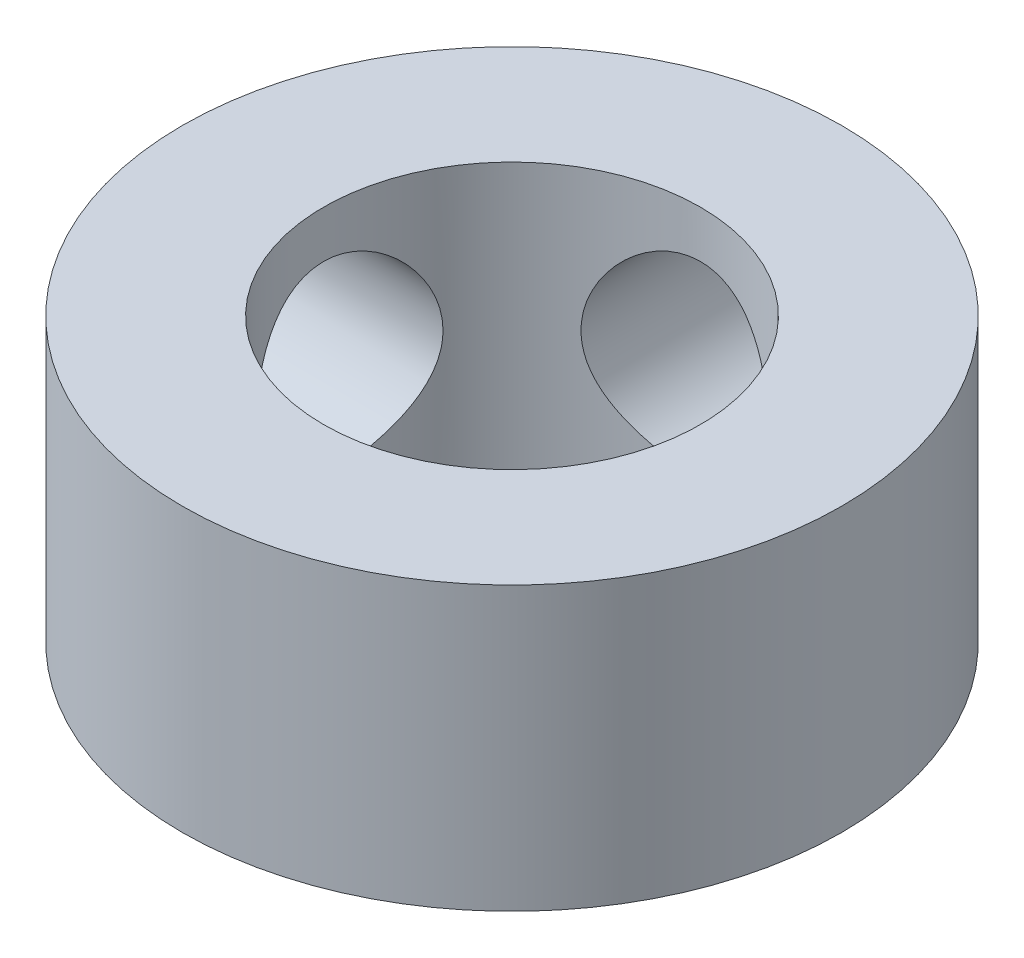
ISO-10303-21;
HEADER;
FILE_DESCRIPTION(('STEP AP214'),'2;1');
FILE_NAME('part.step','',(''),(''),'','','');
FILE_SCHEMA(('AUTOMOTIVE_DESIGN { 1 0 10303 214 1 1 1 1 }'));
ENDSEC;
DATA;
#1=APPLICATION_CONTEXT('core data for automotive mechanical design processes');
#2=APPLICATION_PROTOCOL_DEFINITION('international standard','automotive_design',2000,#1);
#3=PRODUCT_CONTEXT('',#1,'mechanical');
#4=PRODUCT('Part','Part','',(#3));
#5=PRODUCT_RELATED_PRODUCT_CATEGORY('part','',(#4));
#6=PRODUCT_DEFINITION_FORMATION('','',#4);
#7=PRODUCT_DEFINITION_CONTEXT('part definition',#1,'design');
#8=PRODUCT_DEFINITION('design','',#6,#7);
#9=PRODUCT_DEFINITION_SHAPE('','',#8);
#10=(LENGTH_UNIT() NAMED_UNIT(*) SI_UNIT(.MILLI.,.METRE.));
#11=(NAMED_UNIT(*) PLANE_ANGLE_UNIT() SI_UNIT($,.RADIAN.));
#12=(NAMED_UNIT(*) SI_UNIT($,.STERADIAN.) SOLID_ANGLE_UNIT());
#13=UNCERTAINTY_MEASURE_WITH_UNIT(LENGTH_MEASURE(1.E-05),#10,'distance_accuracy_value','');
#14=(GEOMETRIC_REPRESENTATION_CONTEXT(3) GLOBAL_UNCERTAINTY_ASSIGNED_CONTEXT((#13)) GLOBAL_UNIT_ASSIGNED_CONTEXT((#10,
#11,#12)) REPRESENTATION_CONTEXT('',''));
#15=CARTESIAN_POINT('',(0.,0.,0.));
#16=DIRECTION('',(0.,0.,1.));
#17=DIRECTION('',(1.,0.,0.));
#18=AXIS2_PLACEMENT_3D('',#15,#16,#17);
#19=CARTESIAN_POINT('',(0.,6.,0.));
#20=DIRECTION('',(0.,1.,0.));
#21=DIRECTION('',(0.,0.,1.));
#22=AXIS2_PLACEMENT_3D('',#19,#20,#21);
#23=PLANE('',#22);
#24=CARTESIAN_POINT('',(0.,6.,0.));
#25=DIRECTION('',(0.,1.,0.));
#26=DIRECTION('',(0.,0.,1.));
#27=AXIS2_PLACEMENT_3D('',#24,#25,#26);
#28=CIRCLE('',#27,7.);
#29=CARTESIAN_POINT('',(0.,6.,7.));
#30=VERTEX_POINT('',#29);
#31=EDGE_CURVE('E10',#30,#30,#28,.T.);
#32=ORIENTED_EDGE('',*,*,#31,.T.);
#33=EDGE_LOOP('',(#32));
#34=FACE_BOUND('',#33,.T.);
#35=CARTESIAN_POINT('',(0.,6.,0.));
#36=DIRECTION('',(0.,1.,0.));
#37=DIRECTION('',(0.,0.,1.));
#38=AXIS2_PLACEMENT_3D('',#35,#36,#37);
#39=CIRCLE('',#38,4.);
#40=CARTESIAN_POINT('',(0.,6.,4.));
#41=VERTEX_POINT('',#40);
#42=EDGE_CURVE('E58',#41,#41,#39,.T.);
#43=ORIENTED_EDGE('',*,*,#42,.F.);
#44=EDGE_LOOP('',(#43));
#45=FACE_BOUND('',#44,.T.);
#46=ADVANCED_FACE('F37',(#34,#45),#23,.T.);
#47=CARTESIAN_POINT('',(0.,0.,0.));
#48=DIRECTION('',(0.,1.,0.));
#49=DIRECTION('',(0.,0.,1.));
#50=AXIS2_PLACEMENT_3D('',#47,#48,#49);
#51=PLANE('',#50);
#52=CARTESIAN_POINT('',(0.,0.,0.));
#53=DIRECTION('',(0.,1.,0.));
#54=DIRECTION('',(0.,0.,1.));
#55=AXIS2_PLACEMENT_3D('',#52,#53,#54);
#56=CIRCLE('',#55,7.);
#57=CARTESIAN_POINT('',(0.,0.,7.));
#58=VERTEX_POINT('',#57);
#59=EDGE_CURVE('E52',#58,#58,#56,.T.);
#60=ORIENTED_EDGE('',*,*,#59,.F.);
#61=EDGE_LOOP('',(#60));
#62=FACE_BOUND('',#61,.T.);
#63=CARTESIAN_POINT('',(0.,0.,0.));
#64=DIRECTION('',(0.,1.,0.));
#65=DIRECTION('',(0.,0.,1.));
#66=AXIS2_PLACEMENT_3D('',#63,#64,#65);
#67=CIRCLE('',#66,4.);
#68=CARTESIAN_POINT('',(0.,0.,4.));
#69=VERTEX_POINT('',#68);
#70=EDGE_CURVE('E61',#69,#69,#67,.T.);
#71=ORIENTED_EDGE('',*,*,#70,.T.);
#72=EDGE_LOOP('',(#71));
#73=FACE_BOUND('',#72,.T.);
#74=ADVANCED_FACE('F100',(#62,#73),#51,.F.);
#75=CARTESIAN_POINT('',(0.,6.,0.));
#76=DIRECTION('',(0.,-1.,0.));
#77=DIRECTION('',(0.,0.,-1.));
#78=AXIS2_PLACEMENT_3D('',#75,#76,#77);
#79=CYLINDRICAL_SURFACE('',#78,7.);
#80=CARTESIAN_POINT('',(0.,5.,-7.));
#81=CARTESIAN_POINT('',(-0.109954902377251,4.99999806043805,-6.99999869294341));
#82=CARTESIAN_POINT('',(-0.219929747872582,4.99090221102389,-6.99738417402043));
#83=CARTESIAN_POINT('',(-0.436691991196989,4.95483572989769,-6.98720905945103));
#84=CARTESIAN_POINT('',(-0.543478166829615,4.92785833392591,-6.97964659210084));
#85=CARTESIAN_POINT('',(-0.75070430073787,4.85699196158349,-6.96040691349073));
#86=CARTESIAN_POINT('',(-0.851152880848224,4.81312656384805,-6.94873544106341));
#87=CARTESIAN_POINT('',(-1.04326876112927,4.70982200852165,-6.92249978316544));
#88=CARTESIAN_POINT('',(-1.13493514117816,4.65038122150964,-6.90793529508022));
#89=CARTESIAN_POINT('',(-1.30929444685894,4.51596498932709,-6.8770473462558));
#90=CARTESIAN_POINT('',(-1.39172372238094,4.44065524614473,-6.86069041945191));
#91=CARTESIAN_POINT('',(-1.54297135792435,4.27735225686232,-6.82826734915641));
#92=CARTESIAN_POINT('',(-1.61178767707782,4.18935711236777,-6.81220124959344));
#93=CARTESIAN_POINT('',(-1.7351979000643,4.00100641720909,-6.78183014875388));
#94=CARTESIAN_POINT('',(-1.78947821103348,3.90043801493514,-6.76756702506018));
#95=CARTESIAN_POINT('',(-1.8802517055398,3.69112798824923,-6.74291343840667));
#96=CARTESIAN_POINT('',(-1.91674871555719,3.58238812792911,-6.73252214244871));
#97=CARTESIAN_POINT('',(-1.96998433013875,3.36276523683446,-6.71713608196016));
#98=CARTESIAN_POINT('',(-1.9872055320285,3.25200863723216,-6.71200978570011));
#99=CARTESIAN_POINT('',(-2.00290667789184,3.0290688515539,-6.70734208201995));
#100=CARTESIAN_POINT('',(-2.00139069409621,2.91688598074978,-6.70779946107612));
#101=CARTESIAN_POINT('',(-1.98004134762903,2.69813138854384,-6.71413034409934));
#102=CARTESIAN_POINT('',(-1.96080325728391,2.59149564881924,-6.71982782697936));
#103=CARTESIAN_POINT('',(-1.90551386085789,2.3830327803724,-6.73571348382811));
#104=CARTESIAN_POINT('',(-1.8694610348125,2.2812060872795,-6.74590206376403));
#105=CARTESIAN_POINT('',(-1.78110681137812,2.08375375556819,-6.7697686351608));
#106=CARTESIAN_POINT('',(-1.72860551172881,1.98822292759833,-6.78348916405649));
#107=CARTESIAN_POINT('',(-1.60898379167885,1.80712343878659,-6.81285216882059));
#108=CARTESIAN_POINT('',(-1.54186011673345,1.72155700226509,-6.82849507221912));
#109=CARTESIAN_POINT('',(-1.39190399673021,1.55942762439363,-6.86066250656356));
#110=CARTESIAN_POINT('',(-1.30857487484533,1.48332552403277,-6.87719804572366));
#111=CARTESIAN_POINT('',(-1.13013228238622,1.34607399635972,-6.90876247218345));
#112=CARTESIAN_POINT('',(-1.03501820148189,1.28492534395829,-6.92379128137825));
#113=CARTESIAN_POINT('',(-0.834923073091444,1.17907126522596,-6.95076528065502));
#114=CARTESIAN_POINT('',(-0.729889817810004,1.13445971319582,-6.96269275497229));
#115=CARTESIAN_POINT('',(-0.513393229967468,1.06366610858318,-6.98199251487585));
#116=CARTESIAN_POINT('',(-0.401931525810145,1.03747941075473,-6.98936594856255));
#117=CARTESIAN_POINT('',(-0.179666388644349,1.00502671429055,-6.99854874514672));
#118=CARTESIAN_POINT('',(-0.0689613468605074,0.998135304626973,-7.00053272850599));
#119=CARTESIAN_POINT('',(0.152026526805583,1.00272726630104,-6.99922084707091));
#120=CARTESIAN_POINT('',(0.262309407757108,1.01420843284592,-6.99592561580629));
#121=CARTESIAN_POINT('',(0.477018633430315,1.05471044431625,-6.98453926685206));
#122=CARTESIAN_POINT('',(0.581518211734843,1.08337318132339,-6.97654613017679));
#123=CARTESIAN_POINT('',(0.78420868620564,1.15700050198467,-6.95667998741883));
#124=CARTESIAN_POINT('',(0.882398851248717,1.20196697088933,-6.94480653265874));
#125=CARTESIAN_POINT('',(1.07204168512003,1.30802333664512,-6.91809961169145));
#126=CARTESIAN_POINT('',(1.16330248654009,1.36944119882533,-6.9032076317834));
#127=CARTESIAN_POINT('',(1.33443852805947,1.5062525059511,-6.87217947098441));
#128=CARTESIAN_POINT('',(1.41431117084304,1.58164913006457,-6.85604300755107));
#129=CARTESIAN_POINT('',(1.56310642834007,1.74720934204944,-6.82368619629443));
#130=CARTESIAN_POINT('',(1.63158542740713,1.83777527555905,-6.80748036858305));
#131=CARTESIAN_POINT('',(1.75239531606757,2.02946258862467,-6.77738894734786));
#132=CARTESIAN_POINT('',(1.8047267674867,2.13058360077126,-6.76350327310608));
#133=CARTESIAN_POINT('',(1.89137454118278,2.34009121097522,-6.73978651242836));
#134=CARTESIAN_POINT('',(1.92578633239654,2.44843576349762,-6.72993400029434));
#135=CARTESIAN_POINT('',(1.9757945006787,2.66970993557479,-6.71542456669526));
#136=CARTESIAN_POINT('',(1.99139657901587,2.78263815507641,-6.71076607094366));
#137=CARTESIAN_POINT('',(2.00298024246851,3.00529603293678,-6.70731703127619));
#138=CARTESIAN_POINT('',(1.99968027644405,3.11498550455666,-6.70831160808103));
#139=CARTESIAN_POINT('',(1.97524710957466,3.33217473066169,-6.71554597206102));
#140=CARTESIAN_POINT('',(1.95411450379873,3.43967455809192,-6.72178558421114));
#141=CARTESIAN_POINT('',(1.89505968816675,3.6483783711686,-6.73866977160527));
#142=CARTESIAN_POINT('',(1.85731091786365,3.74963538701117,-6.74926877048974));
#143=CARTESIAN_POINT('',(1.76622949301581,3.9444587344922,-6.77367302842112));
#144=CARTESIAN_POINT('',(1.71289408043152,4.03802370127323,-6.78747885482392));
#145=CARTESIAN_POINT('',(1.59006546534828,4.21818352180533,-6.81731668949935));
#146=CARTESIAN_POINT('',(1.52009227722732,4.30444139134196,-6.83340763179064));
#147=CARTESIAN_POINT('',(1.36685984037935,4.46422389580982,-6.86569845092232));
#148=CARTESIAN_POINT('',(1.28359725072856,4.5377453191108,-6.88189835417168));
#149=CARTESIAN_POINT('',(1.10357432086539,4.67183718432662,-6.91307959572365));
#150=CARTESIAN_POINT('',(1.00652250235978,4.73202698726963,-6.92801901037413));
#151=CARTESIAN_POINT('',(0.80325052964666,4.83514578502201,-6.95451395777971));
#152=CARTESIAN_POINT('',(0.697035424114739,4.87808421193306,-6.96607133870287));
#153=CARTESIAN_POINT('',(0.492916315335034,4.94084755139545,-6.98327344725308));
#154=CARTESIAN_POINT('',(0.39576300762439,4.96297353668456,-6.98949684362076));
#155=CARTESIAN_POINT('',(0.199078368786367,4.99254965724214,-6.99786043852147));
#156=CARTESIAN_POINT('',(0.0995473576160916,5.00000175597688,-7.00000118333996));
#157=CARTESIAN_POINT('',(0.,5.,-7.));
#158=B_SPLINE_CURVE_WITH_KNOTS('',3,(#80,#81,#82,#83,#84,#85,#86,#87,#88,#89,#90,#91,#92,#93,
#94,#95,#96,#97,#98,#99,#100,#101,#102,#103,#104,#105,#106,#107,#108,#109,#110,#111,#112,#113,
#114,#115,#116,#117,#118,#119,#120,#121,#122,#123,#124,#125,#126,#127,#128,#129,#130,#131,#132,
#133,#134,#135,#136,#137,#138,#139,#140,#141,#142,#143,#144,#145,#146,#147,#148,#149,#150,#151,
#152,#153,#154,#155,#156,#157),.UNSPECIFIED.,.T.,.F.,(4,2,2,2,2,2,2,2,2,2,2,2,2,2,2,2,2,2,2,2,2,
2,2,2,2,2,2,2,2,2,2,2,2,2,2,2,2,2,4),(0.,0.329499312542344,0.65912333979518,0.988288812895343,
1.31748873543516,1.65447811530781,1.99151797873713,2.33533075300057,2.67906951544809,
3.0139950986275,3.34884789231233,3.67284785829333,3.99687711786126,4.3250080329121,
4.65321205577343,4.99378500602502,5.33437560155449,5.67687101104449,6.01928004014612,
6.35045457698201,6.68158937434649,7.00605140479519,7.33055096575529,7.66207525344452,
7.99367503187788,8.33612104884334,8.67855514965298,9.01914573366139,9.35963305787734,
9.68726681616472,10.0148896418598,10.3391709629126,10.6635096999758,10.9986765689036,
11.3339278310847,11.6777797897016,12.0214434923409,12.3197946803794,12.6181059442772),.UNSPECIFIED.);
#159=CARTESIAN_POINT('',(0.,5.,-7.));
#160=VERTEX_POINT('',#159);
#161=EDGE_CURVE('E71',#160,#160,#158,.T.);
#162=ORIENTED_EDGE('',*,*,#161,.T.);
#163=EDGE_LOOP('',(#162));
#164=FACE_BOUND('',#163,.T.);
#165=CARTESIAN_POINT('',(-6.70820393249937,3.,-2.));
#166=CARTESIAN_POINT('',(-6.70820547009708,3.10985153787724,-1.99999802046393));
#167=CARTESIAN_POINT('',(-6.71093179679208,3.21972308425451,-1.9909186659955));
#168=CARTESIAN_POINT('',(-6.72150389207102,3.43627123886298,-1.95492363390195));
#169=CARTESIAN_POINT('',(-6.72935174296489,3.54294652910063,-1.92800070136334));
#170=CARTESIAN_POINT('',(-6.74920709521546,3.7499372008715,-1.85729343292866));
#171=CARTESIAN_POINT('',(-6.76120815257369,3.85026215181714,-1.81353520651874));
#172=CARTESIAN_POINT('',(-6.78800921096146,4.04216781155437,-1.71048364062938));
#173=CARTESIAN_POINT('',(-6.80280954425194,4.13374748037804,-1.65118845666347));
#174=CARTESIAN_POINT('',(-6.83401783214154,4.30819156531483,-1.51692480098199));
#175=CARTESIAN_POINT('',(-6.8504575596415,4.39076780212922,-1.4415892111325));
#176=CARTESIAN_POINT('',(-6.88281965512018,4.54230278330379,-1.27817124546927));
#177=CARTESIAN_POINT('',(-6.89874196233652,4.61125993312284,-1.19008737915963));
#178=CARTESIAN_POINT('',(-6.92863332001512,4.73482864835352,-1.00164603215759));
#179=CARTESIAN_POINT('',(-6.94256054500866,4.78914961975098,-0.901090783761867));
#180=CARTESIAN_POINT('',(-6.96652540485531,4.88000177441597,-0.691808475239639));
#181=CARTESIAN_POINT('',(-6.97656379690866,4.91653642124027,-0.583083010875172));
#182=CARTESIAN_POINT('',(-6.99139519300235,4.96983446123971,-0.363558575121178));
#183=CARTESIAN_POINT('',(-6.99631827011303,4.98708902170467,-0.25288779812904));
#184=CARTESIAN_POINT('',(-7.00082095659694,5.00288673388324,-0.0301201024219234));
#185=CARTESIAN_POINT('',(-7.00040158738982,5.00143346233736,0.0819765395885488));
#186=CARTESIAN_POINT('',(-6.99436006763307,4.98019362508198,0.300980195735221));
#187=CARTESIAN_POINT('',(-6.98888870776051,4.96093838736202,0.407943546108946));
#188=CARTESIAN_POINT('',(-6.97353886330137,4.90550489753563,0.617052222177618));
#189=CARTESIAN_POINT('',(-6.96366011056224,4.86932561573788,0.719197254300509));
#190=CARTESIAN_POINT('',(-6.94039031772111,4.78069059918818,0.917073833728924));
#191=CARTESIAN_POINT('',(-6.92696205512133,4.72806122219167,1.01272304385077));
#192=CARTESIAN_POINT('',(-6.89802768974041,4.60815541360198,1.19400724359048));
#193=CARTESIAN_POINT('',(-6.8825211319195,4.54087577233352,1.27964003241601));
#194=CARTESIAN_POINT('',(-6.85045683019623,4.39079428938141,1.44163264854775));
#195=CARTESIAN_POINT('',(-6.83388129369387,4.30753056639495,1.51756157758489));
#196=CARTESIAN_POINT('',(-6.80202973786992,4.12928490815404,1.65449301574976));
#197=CARTESIAN_POINT('',(-6.78675382405366,4.034302023051,1.71549431378261));
#198=CARTESIAN_POINT('',(-6.75915174814409,3.83426911550201,1.82123335985447));
#199=CARTESIAN_POINT('',(-6.74685010938643,3.72914477494834,1.86583737788771));
#200=CARTESIAN_POINT('',(-6.72688544387341,3.51244683649538,1.9365895149609));
#201=CARTESIAN_POINT('',(-6.71922106753542,3.40087512534009,1.9627430040271));
#202=CARTESIAN_POINT('',(-6.70969115196194,3.17851957566769,1.99507417199885));
#203=CARTESIAN_POINT('',(-6.70763711316669,3.06783818306698,2.00190148157354));
#204=CARTESIAN_POINT('',(-6.7090415959684,2.84691168407903,1.99718996719665));
#205=CARTESIAN_POINT('',(-6.71249942992568,2.73666652498908,1.98565343424642));
#206=CARTESIAN_POINT('',(-6.72435430053723,2.52235877197704,1.94511781425928));
#207=CARTESIAN_POINT('',(-6.73263642965451,2.41821241398484,1.9165246218414));
#208=CARTESIAN_POINT('',(-6.75309063930731,2.21619812800226,1.84315161866429));
#209=CARTESIAN_POINT('',(-6.7652632811114,2.11833110835435,1.79836947226768));
#210=CARTESIAN_POINT('',(-6.79250188009389,1.92897792478325,1.69261965121623));
#211=CARTESIAN_POINT('',(-6.80763197381122,1.83770955579781,1.63127891729131));
#212=CARTESIAN_POINT('',(-6.83893726549831,1.66652362655664,1.49460463684841));
#213=CARTESIAN_POINT('',(-6.85511268947611,1.58660853298786,1.41926805768137));
#214=CARTESIAN_POINT('',(-6.88734727436087,1.43762058171181,1.25370800996556));
#215=CARTESIAN_POINT('',(-6.90338406046143,1.36900502858127,1.16306771024055));
#216=CARTESIAN_POINT('',(-6.93297977045999,1.24795431861727,0.971185307057545));
#217=CARTESIAN_POINT('',(-6.94653882385412,1.19551831607762,0.869943758098183));
#218=CARTESIAN_POINT('',(-6.96956504846406,1.10881571297367,0.660433272956165));
#219=CARTESIAN_POINT('',(-6.97906308127247,1.07441161041384,0.552224799899634));
#220=CARTESIAN_POINT('',(-6.99303339623885,1.02437319805982,0.331245648549922));
#221=CARTESIAN_POINT('',(-6.99750697123019,1.00873405981868,0.218476151585437));
#222=CARTESIAN_POINT('',(-7.00085335003284,0.997008566002211,-0.00417823795902964));
#223=CARTESIAN_POINT('',(-6.99991703588995,1.00025585091718,-0.114025631049957));
#224=CARTESIAN_POINT('',(-6.99299069122135,1.02463828141029,-0.331545172422004));
#225=CARTESIAN_POINT('',(-6.98700090270593,1.04577257038204,-0.439217424617532));
#226=CARTESIAN_POINT('',(-6.97068801860116,1.10493136097885,-0.648404133039588));
#227=CARTESIAN_POINT('',(-6.96040414048174,1.14280317894398,-0.74996503343505));
#228=CARTESIAN_POINT('',(-6.93657094143453,1.23422615828548,-0.945347202761462));
#229=CARTESIAN_POINT('',(-6.92302111501784,1.28777974709225,-1.03916727058068));
#230=CARTESIAN_POINT('',(-6.89358955440188,1.41089733742482,-1.21943345635391));
#231=CARTESIAN_POINT('',(-6.8776504578623,1.48089008678841,-1.30557732800707));
#232=CARTESIAN_POINT('',(-6.84544064986529,1.63410912545394,-1.46512122231839));
#233=CARTESIAN_POINT('',(-6.82916984787116,1.71733907108483,-1.53851771218981));
#234=CARTESIAN_POINT('',(-6.79764037543869,1.89729691699546,-1.67240846029126));
#235=CARTESIAN_POINT('',(-6.78241951768489,1.99432194750348,-1.73251316723594));
#236=CARTESIAN_POINT('',(-6.7552844533164,2.19752186531463,-1.83547943619619));
#237=CARTESIAN_POINT('',(-6.74336839719835,2.30369159108834,-1.8783506488486));
#238=CARTESIAN_POINT('',(-6.72558459556592,2.50765370023265,-1.94098534012467));
#239=CARTESIAN_POINT('',(-6.71912438833989,2.60469034810252,-1.96305899981724));
#240=CARTESIAN_POINT('',(-6.71043369466525,2.80114611835192,-1.99256607043695));
#241=CARTESIAN_POINT('',(-6.70820254070055,2.9005648622311,-2.00000179183146));
#242=CARTESIAN_POINT('',(-6.70820393249937,3.,-2.));
#243=B_SPLINE_CURVE_WITH_KNOTS('',3,(#165,#166,#167,#168,#169,#170,#171,#172,#173,#174,#175,
#176,#177,#178,#179,#180,#181,#182,#183,#184,#185,#186,#187,#188,#189,#190,#191,#192,#193,#194,
#195,#196,#197,#198,#199,#200,#201,#202,#203,#204,#205,#206,#207,#208,#209,#210,#211,#212,#213,
#214,#215,#216,#217,#218,#219,#220,#221,#222,#223,#224,#225,#226,#227,#228,#229,#230,#231,#232,
#233,#234,#235,#236,#237,#238,#239,#240,#241,#242),.UNSPECIFIED.,.T.,.F.,(4,2,2,2,2,2,2,2,2,2,2,
2,2,2,2,2,2,2,2,2,2,2,2,2,2,2,2,2,2,2,2,2,2,2,2,2,2,2,4),(0.,0.32918834236395,0.658510609618863,
0.987324183736438,1.31617681100735,1.65357167206616,1.99100601238483,2.33471483013846,
2.67835669017706,3.01302901028742,3.34763734552418,3.67257037643422,3.99752317946522,
4.32602903378491,4.65460693184835,4.99471612693,5.3348529062976,5.67770520630006,
6.02045767793012,6.35154363333481,6.6825882869845,7.00605289656512,7.32956419216041,
7.66108006042382,7.99266784620105,8.33545388376657,8.67822200084648,9.0183368529809,
9.35836417076638,9.6864689768406,10.0145580709057,10.3397141238921,10.6649205354322,
10.9997976874537,11.3347674991531,11.6785361242131,12.0221119721565,12.3201328886649,
12.61810676147),.UNSPECIFIED.);
#244=CARTESIAN_POINT('',(-6.70820393249937,3.,-2.));
#245=VERTEX_POINT('',#244);
#246=EDGE_CURVE('E70',#245,#245,#243,.T.);
#247=ORIENTED_EDGE('',*,*,#246,.T.);
#248=EDGE_LOOP('',(#247));
#249=FACE_BOUND('',#248,.T.);
#250=ORIENTED_EDGE('',*,*,#31,.F.);
#251=EDGE_LOOP('',(#250));
#252=FACE_BOUND('',#251,.T.);
#253=ORIENTED_EDGE('',*,*,#59,.T.);
#254=EDGE_LOOP('',(#253));
#255=FACE_BOUND('',#254,.T.);
#256=ADVANCED_FACE('F39',(#164,#249,#252,#255),#79,.T.);
#257=CARTESIAN_POINT('',(0.,6.,0.));
#258=DIRECTION('',(0.,-1.,0.));
#259=DIRECTION('',(0.,0.,-1.));
#260=AXIS2_PLACEMENT_3D('',#257,#258,#259);
#261=CYLINDRICAL_SURFACE('',#260,4.);
#262=CARTESIAN_POINT('',(0.,5.,-4.));
#263=CARTESIAN_POINT('',(-0.105143925902467,4.99999339536562,-3.99999426810082));
#264=CARTESIAN_POINT('',(-0.210413199395125,4.99165985375789,-3.99580982039513));
#265=CARTESIAN_POINT('',(-0.417840470537792,4.95869423931692,-3.97948312074314));
#266=CARTESIAN_POINT('',(-0.519992173427259,4.93403121400437,-3.96732575657839));
#267=CARTESIAN_POINT('',(-0.717867089760897,4.86961238276674,-3.93632558806751));
#268=CARTESIAN_POINT('',(-0.813613605878292,4.82991523150406,-3.91750878355075));
#269=CARTESIAN_POINT('',(-0.996945233613197,4.73685875727003,-3.87491553031523));
#270=CARTESIAN_POINT('',(-1.08453098798012,4.68350051150227,-3.85113947267051));
#271=CARTESIAN_POINT('',(-1.25501563552382,4.56096550102943,-3.79912516516124));
#272=CARTESIAN_POINT('',(-1.33731042224422,4.49102704152072,-3.77070398255074));
#273=CARTESIAN_POINT('',(-1.48955888973396,4.33895704150593,-3.71319940493486));
#274=CARTESIAN_POINT('',(-1.55950316621353,4.25681629645512,-3.68411552418069));
#275=CARTESIAN_POINT('',(-1.69050400090056,4.07503330095324,-3.62597902394695));
#276=CARTESIAN_POINT('',(-1.75045067110327,3.97452780330817,-3.59710373940264));
#277=CARTESIAN_POINT('',(-1.85233645378139,3.76326532802757,-3.54571957544641));
#278=CARTESIAN_POINT('',(-1.89428842993267,3.6525157425545,-3.52320615213979));
#279=CARTESIAN_POINT('',(-1.95626488437718,3.43066978915616,-3.48915734075617));
#280=CARTESIAN_POINT('',(-1.97745171416088,3.31999109586521,-3.47704543167427));
#281=CARTESIAN_POINT('',(-2.00085398661769,3.09604232444105,-3.46363779897055));
#282=CARTESIAN_POINT('',(-2.00308817674615,2.98277491825769,-3.46233138686576));
#283=CARTESIAN_POINT('',(-1.98937457434459,2.77142795136926,-3.47021860514497));
#284=CARTESIAN_POINT('',(-1.97556911907364,2.6731519375539,-3.47817527324027));
#285=CARTESIAN_POINT('',(-1.93387969811386,2.48055618125391,-3.50152457467701));
#286=CARTESIAN_POINT('',(-1.9059912477953,2.38623770938937,-3.51691957663553));
#287=CARTESIAN_POINT('',(-1.83641956077201,2.20154173486868,-3.55374952825482));
#288=CARTESIAN_POINT('',(-1.79443013423199,2.11130720242842,-3.57531681327997));
#289=CARTESIAN_POINT('',(-1.698083375336,1.93873141481998,-3.62206808562807));
#290=CARTESIAN_POINT('',(-1.64372048762493,1.85639372879982,-3.64725369560381));
#291=CARTESIAN_POINT('',(-1.51613210982558,1.69095749451355,-3.70226315806572));
#292=CARTESIAN_POINT('',(-1.44138891673856,1.60908625284769,-3.73227020473492));
#293=CARTESIAN_POINT('',(-1.27911115748275,1.4585291628182,-3.79095246600814));
#294=CARTESIAN_POINT('',(-1.19157051314857,1.38984961593223,-3.81962703917602));
#295=CARTESIAN_POINT('',(-1.0010330116637,1.26462867794055,-3.87403974565928));
#296=CARTESIAN_POINT('',(-0.897507183198817,1.20879905510852,-3.89957968324015));
#297=CARTESIAN_POINT('',(-0.680932430977593,1.11580594191398,-3.94315762242485));
#298=CARTESIAN_POINT('',(-0.567891152530551,1.07862762996967,-3.96120157887106));
#299=CARTESIAN_POINT('',(-0.345532983321404,1.02704919256665,-3.98648667482871));
#300=CARTESIAN_POINT('',(-0.236683061096652,1.01101752850644,-3.9944987660262));
#301=CARTESIAN_POINT('',(-0.0175591998987023,0.997070537731026,-4.00146026918207));
#302=CARTESIAN_POINT('',(0.0927140397398183,0.999146628721064,-4.00041397442637));
#303=CARTESIAN_POINT('',(0.302465943971975,1.02041337683749,-3.9898238450687));
#304=CARTESIAN_POINT('',(0.402118816099861,1.03826506545999,-3.98094491376337));
#305=CARTESIAN_POINT('',(0.596813784603883,1.08847614379024,-3.9564434262968));
#306=CARTESIAN_POINT('',(0.691855371382175,1.12083713290699,-3.94082012668824));
#307=CARTESIAN_POINT('',(0.877777216899146,1.19999693286607,-3.90368502827176));
#308=CARTESIAN_POINT('',(0.968460794011607,1.24718210023257,-3.88201763539261));
#309=CARTESIAN_POINT('',(1.14092272339854,1.35421507129314,-3.83487948634835));
#310=CARTESIAN_POINT('',(1.22269725955318,1.41406826919079,-3.80940711133877));
#311=CARTESIAN_POINT('',(1.38353537857843,1.55152085066143,-3.75416442672396));
#312=CARTESIAN_POINT('',(1.46154415563805,1.63028573689029,-3.72421769686998));
#313=CARTESIAN_POINT('',(1.60371264223771,1.79985030255546,-3.6652478321764));
#314=CARTESIAN_POINT('',(1.66786277142375,1.89065823769584,-3.63622534800094));
#315=CARTESIAN_POINT('',(1.78341582895804,2.08728730834595,-3.58102384412979));
#316=CARTESIAN_POINT('',(1.8340509916005,2.19362253218896,-3.55505059178121));
#317=CARTESIAN_POINT('',(1.91616565186941,2.41502013514993,-3.51148144588269));
#318=CARTESIAN_POINT('',(1.94766983173403,2.53007105293378,-3.493874764435));
#319=CARTESIAN_POINT('',(1.98772337493374,2.75382044576941,-3.47123002051604));
#320=CARTESIAN_POINT('',(1.9981859928109,2.86206850687048,-3.4651476693013));
#321=CARTESIAN_POINT('',(2.0013783087524,3.07889413432905,-3.46330709283206));
#322=CARTESIAN_POINT('',(1.99411569324648,3.18747153747572,-3.4675443925278));
#323=CARTESIAN_POINT('',(1.96385225118662,3.39096700306687,-3.48475724102153));
#324=CARTESIAN_POINT('',(1.94241662868607,3.48620094028948,-3.49686188965317));
#325=CARTESIAN_POINT('',(1.88635071644882,3.67161623884873,-3.52742032375305));
#326=CARTESIAN_POINT('',(1.85171618231984,3.76179596418406,-3.54587615139337));
#327=CARTESIAN_POINT('',(1.76763149060113,3.94124970197307,-3.58857060729071));
#328=CARTESIAN_POINT('',(1.7173422756314,4.03005580365806,-3.61311444791841));
#329=CARTESIAN_POINT('',(1.60430194327478,4.19854907236252,-3.66470663269721));
#330=CARTESIAN_POINT('',(1.54154434248312,4.27823146104222,-3.69175627591221));
#331=CARTESIAN_POINT('',(1.39640665332275,4.43628396470935,-3.74924646316184));
#332=CARTESIAN_POINT('',(1.31256884599452,4.51331820470058,-3.77969966613256));
#333=CARTESIAN_POINT('',(1.13230961246639,4.65252596687054,-3.83755504519861));
#334=CARTESIAN_POINT('',(1.03588144661039,4.71469147893981,-3.8649555725239));
#335=CARTESIAN_POINT('',(0.831863193565891,4.82247272542414,-3.91396019133075));
#336=CARTESIAN_POINT('',(0.724199007553461,4.86796833847294,-3.93552192987866));
#337=CARTESIAN_POINT('',(0.501484202276173,4.93961633551482,-3.97002682597974));
#338=CARTESIAN_POINT('',(0.3864555991782,4.96582369361143,-3.98299446726136));
#339=CARTESIAN_POINT('',(0.22520389298179,4.98779482217148,-3.99390923826956));
#340=CARTESIAN_POINT('',(0.180323758883129,4.99236528173268,-3.99618730680502));
#341=CARTESIAN_POINT('',(0.090303463610183,4.99846933102817,-3.99923393953631));
#342=CARTESIAN_POINT('',(0.0451632952932568,5.00000283694042,-4.00000246206762));
#343=CARTESIAN_POINT('',(0.,5.,-4.));
#344=B_SPLINE_CURVE_WITH_KNOTS('',3,(#262,#263,#264,#265,#266,#267,#268,#269,#270,#271,#272,
#273,#274,#275,#276,#277,#278,#279,#280,#281,#282,#283,#284,#285,#286,#287,#288,#289,#290,#291,
#292,#293,#294,#295,#296,#297,#298,#299,#300,#301,#302,#303,#304,#305,#306,#307,#308,#309,#310,
#311,#312,#313,#314,#315,#316,#317,#318,#319,#320,#321,#322,#323,#324,#325,#326,#327,#328,#329,
#330,#331,#332,#333,#334,#335,#336,#337,#338,#339,#340,#341,#342,#343),.UNSPECIFIED.,.T.,.F.,(4,
2,2,2,2,2,2,2,2,2,2,2,2,2,2,2,2,2,2,2,2,2,2,2,2,2,2,2,2,2,2,2,2,2,2,2,2,2,2,2,4),(0.,
0.315248514840585,0.631096299418395,0.945724310984596,1.26032752116313,1.59396351743618,
1.92785247530807,2.28763452861505,2.64715895796562,2.98516024280459,3.32282714658041,
3.62011424818641,3.91749607851357,4.22180480336975,4.52625042520444,4.86929882667757,
5.21251069197373,5.57166044428881,5.93052433824559,6.25966580942691,6.58865129022952,
6.89213813012244,7.19565843261863,7.50785712055797,7.82018901496679,8.16319221288838,
8.50643177230864,8.86629364323452,9.22569023890902,9.55058615006093,9.87534119729357,
10.1691586049771,10.463070575767,10.7767291356057,11.0905512228726,11.4425048551434,
11.7946476676249,12.1492802732705,12.502898172423,12.6383056026783,12.7737167702213),.UNSPECIFIED.);
#345=CARTESIAN_POINT('',(0.,5.,-4.));
#346=VERTEX_POINT('',#345);
#347=EDGE_CURVE('E42',#346,#346,#344,.T.);
#348=ORIENTED_EDGE('',*,*,#347,.F.);
#349=EDGE_LOOP('',(#348));
#350=FACE_BOUND('',#349,.T.);
#351=CARTESIAN_POINT('',(-3.46410161513775,3.,-2.));
#352=CARTESIAN_POINT('',(-3.46411185715888,3.10421320547434,-1.99999158748781));
#353=CARTESIAN_POINT('',(-3.46887633544978,3.2085621765338,-1.99179963610437));
#354=CARTESIAN_POINT('',(-3.48724701669072,3.4140551772306,-1.95944672580053));
#355=CARTESIAN_POINT('',(-3.50087179788183,3.51519200324776,-1.93525221095662));
#356=CARTESIAN_POINT('',(-3.53498701490001,3.71090315644693,-1.8721998159803));
#357=CARTESIAN_POINT('',(-3.55544089069169,3.80550925884925,-1.83341988295964));
#358=CARTESIAN_POINT('',(-3.60085327291133,3.98684845047615,-1.74253507245138));
#359=CARTESIAN_POINT('',(-3.62581202301253,4.07358111343677,-1.69042947410139));
#360=CARTESIAN_POINT('',(-3.67993738819289,4.24461144313338,-1.569333074538));
#361=CARTESIAN_POINT('',(-3.70928127465103,4.32811826759177,-1.49930407053533));
#362=CARTESIAN_POINT('',(-3.76743965382121,4.4828167805706,-1.34650761698202));
#363=CARTESIAN_POINT('',(-3.79625387610258,4.55400232620397,-1.26373385204841));
#364=CARTESIAN_POINT('',(-3.85242953961661,4.6867343011885,-1.08097912631265));
#365=CARTESIAN_POINT('',(-3.87956212851245,4.74730753542331,-0.980214377887153));
#366=CARTESIAN_POINT('',(-3.92701512184167,4.85028170678709,-0.768314053336917));
#367=CARTESIAN_POINT('',(-3.94733982363631,4.8926941123508,-0.657185076311985));
#368=CARTESIAN_POINT('',(-3.97760922492053,4.95500932253118,-0.436089887818817));
#369=CARTESIAN_POINT('',(-3.9881896044274,4.9762990526921,-0.326603580968785));
#370=CARTESIAN_POINT('',(-4.00015167691179,5.00033223736903,-0.10514125740454));
#371=CARTESIAN_POINT('',(-4.00153893568935,5.00308691359628,0.00683321168520793));
#372=CARTESIAN_POINT('',(-3.99525963833124,4.99050665205486,0.219665048849573));
#373=CARTESIAN_POINT('',(-3.98836991784381,4.97672396895636,0.320642398354139));
#374=CARTESIAN_POINT('',(-3.96748490519435,4.93423831219188,0.518627543836089));
#375=CARTESIAN_POINT('',(-3.95348908132771,4.90553422204788,0.615635042187701));
#376=CARTESIAN_POINT('',(-3.91943166575325,4.83383486782005,0.804618783139259));
#377=CARTESIAN_POINT('',(-3.89928883058403,4.79064737365578,0.896506847030398));
#378=CARTESIAN_POINT('',(-3.8547529197337,4.6914731675971,1.07195360302662));
#379=CARTESIAN_POINT('',(-3.83035832314967,4.63548187339533,1.15550929767728));
#380=CARTESIAN_POINT('',(-3.7768878879846,4.50620929693394,1.3203473217964));
#381=CARTESIAN_POINT('',(-3.7475875199635,4.43179394334797,1.40066815005872));
#382=CARTESIAN_POINT('',(-3.68908681173623,4.27082055013966,1.54820874059556));
#383=CARTESIAN_POINT('',(-3.65988656531257,4.18425325545188,1.61541842314846));
#384=CARTESIAN_POINT('',(-3.60288312184969,3.99470361515182,1.73901066928442));
#385=CARTESIAN_POINT('',(-3.57528639981415,3.89102795389158,1.7944346299561));
#386=CARTESIAN_POINT('',(-3.52750900557152,3.674124657282,1.88663822600246));
#387=CARTESIAN_POINT('',(-3.50732060092135,3.56090713396487,1.92343731642178));
#388=CARTESIAN_POINT('',(-3.47889271634069,3.33757097743442,1.97436042205008));
#389=CARTESIAN_POINT('',(-3.46983311696993,3.2279177619129,1.99005024423995));
#390=CARTESIAN_POINT('',(-3.46235838723219,3.00719731696691,2.00303389322285));
#391=CARTESIAN_POINT('',(-3.46393573778623,2.8961311417604,2.00034071463005));
#392=CARTESIAN_POINT('',(-3.4766867308117,2.68869216284256,1.97807208668793));
#393=CARTESIAN_POINT('',(-3.48679175013308,2.59204109778422,1.96037563342492));
#394=CARTESIAN_POINT('',(-3.51388043102682,2.40326442745801,1.91139256926489));
#395=CARTESIAN_POINT('',(-3.53086632010068,2.31114029850652,1.88010155724727));
#396=CARTESIAN_POINT('',(-3.57072444159313,2.12917733819489,1.80329517720973));
#397=CARTESIAN_POINT('',(-3.59383286486126,2.03964196629395,1.7571881273853));
#398=CARTESIAN_POINT('',(-3.643122389945,1.86906145692096,1.65257412803176));
#399=CARTESIAN_POINT('',(-3.66930506710298,1.78802071296949,1.59406080866498));
#400=CARTESIAN_POINT('',(-3.72575996912669,1.62604246495734,1.45767433439709));
#401=CARTESIAN_POINT('',(-3.75613166308566,1.54640569858222,1.37829054462748));
#402=CARTESIAN_POINT('',(-3.81468469955797,1.40117552399527,1.20680899079904));
#403=CARTESIAN_POINT('',(-3.84286530015463,1.33558685947316,1.11470694931991));
#404=CARTESIAN_POINT('',(-3.89482723381868,1.21885254816729,0.917070725108059));
#405=CARTESIAN_POINT('',(-3.91847283343884,1.16813376383323,0.811246195112495));
#406=CARTESIAN_POINT('',(-3.95766709918776,1.08572419203039,0.591044729317866));
#407=CARTESIAN_POINT('',(-3.97322287353397,1.0540166963159,0.476675402917653));
#408=CARTESIAN_POINT('',(-3.99335016363174,1.01326287251486,0.253959364539764));
#409=CARTESIAN_POINT('',(-3.9987985581427,1.00240425133572,0.1460228872683));
#410=CARTESIAN_POINT('',(-4.00084260752374,0.998313466004326,-0.0702519714699454));
#411=CARTESIAN_POINT('',(-3.99744136141634,1.00507513147113,-0.178590198981614));
#412=CARTESIAN_POINT('',(-3.98267937668509,1.0348328243164,-0.385075986136858));
#413=CARTESIAN_POINT('',(-3.97185789309443,1.05672973730905,-0.483424641057418));
#414=CARTESIAN_POINT('',(-3.94384187353387,1.11465395980667,-0.674891898931564));
#415=CARTESIAN_POINT('',(-3.92664642364424,1.15068329570691,-0.768009749669771));
#416=CARTESIAN_POINT('',(-3.8865186139318,1.2374542549914,-0.950846833596741));
#417=CARTESIAN_POINT('',(-3.86337234005404,1.28875921975186,-1.0402503657229));
#418=CARTESIAN_POINT('',(-3.81376266676027,1.40391528811809,-1.20954920326828));
#419=CARTESIAN_POINT('',(-3.78729774583428,1.46777215410157,-1.28944011444319));
#420=CARTESIAN_POINT('',(-3.73057218840582,1.61359663555941,-1.44582833859495));
#421=CARTESIAN_POINT('',(-3.70019591726075,1.69673418080028,-1.52119665879199));
#422=CARTESIAN_POINT('',(-3.64126158628571,1.87489222830609,-1.65732528394006));
#423=CARTESIAN_POINT('',(-3.61270515130784,1.96992313136051,-1.71807266521244));
#424=CARTESIAN_POINT('',(-3.55999186256751,2.17330889413024,-1.82486714716811));
#425=CARTESIAN_POINT('',(-3.53600256268535,2.28198991073527,-1.87038902381914));
#426=CARTESIAN_POINT('',(-3.5069621813237,2.45057811963094,-1.92395929504801));
#427=CARTESIAN_POINT('',(-3.49844389329401,2.50764782059068,-1.93935666147967));
#428=CARTESIAN_POINT('',(-3.48406059323535,2.62323255750019,-1.96508069805043));
#429=CARTESIAN_POINT('',(-3.47819372636051,2.68174655275425,-1.97541091343282));
#430=CARTESIAN_POINT('',(-3.47059023668758,2.78360078924729,-1.9887293296122));
#431=CARTESIAN_POINT('',(-3.46816389731816,2.82673305725007,-1.99295091983786));
#432=CARTESIAN_POINT('',(-3.46491740045177,2.9132356930929,-1.99858810035606));
#433=CARTESIAN_POINT('',(-3.46409735040492,2.9566060766667,-2.00000350293331));
#434=CARTESIAN_POINT('',(-3.46410161513775,3.,-2.));
#435=B_SPLINE_CURVE_WITH_KNOTS('',3,(#351,#352,#353,#354,#355,#356,#357,#358,#359,#360,#361,
#362,#363,#364,#365,#366,#367,#368,#369,#370,#371,#372,#373,#374,#375,#376,#377,#378,#379,#380,
#381,#382,#383,#384,#385,#386,#387,#388,#389,#390,#391,#392,#393,#394,#395,#396,#397,#398,#399,
#400,#401,#402,#403,#404,#405,#406,#407,#408,#409,#410,#411,#412,#413,#414,#415,#416,#417,#418,
#419,#420,#421,#422,#423,#424,#425,#426,#427,#428,#429,#430,#431,#432,#433,#434),.UNSPECIFIED.,
.T.,.F.,(4,2,2,2,2,2,2,2,2,2,2,2,2,2,2,2,2,2,2,2,2,2,2,2,2,2,2,2,2,2,2,2,2,2,2,2,2,2,2,2,2,4),
(0.,0.312464245189432,0.62558578564961,0.937057191861536,1.24854545093096,1.58572462503713,
1.92307142172809,2.28315784481594,2.64301653931849,2.97726969939937,3.31132047376147,
3.61632194973143,3.92134625038977,4.2305906946636,4.5399459870461,4.87854382917848,
5.21740096495904,5.57777683462963,5.93777548427476,6.2692458171249,6.60048186380813,
6.89548366852118,7.19058104876193,7.49934592816242,7.80826972444161,8.15613487165293,
8.50411729960471,8.86128362829998,9.2181355962161,9.5422454078304,9.8662417359201,
10.1688884974705,10.4715786702809,10.7872150144301,11.1029966020551,11.450204837042,
11.7977188569438,12.1562149808128,12.3351395323571,12.5139387197526,12.6440387634036,
12.7741475095882),.UNSPECIFIED.);
#436=CARTESIAN_POINT('',(-3.46410161513775,3.,-2.));
#437=VERTEX_POINT('',#436);
#438=EDGE_CURVE('E63',#437,#437,#435,.T.);
#439=ORIENTED_EDGE('',*,*,#438,.F.);
#440=EDGE_LOOP('',(#439));
#441=FACE_BOUND('',#440,.T.);
#442=ORIENTED_EDGE('',*,*,#42,.T.);
#443=EDGE_LOOP('',(#442));
#444=FACE_BOUND('',#443,.T.);
#445=ORIENTED_EDGE('',*,*,#70,.F.);
#446=EDGE_LOOP('',(#445));
#447=FACE_BOUND('',#446,.T.);
#448=ADVANCED_FACE('F72',(#350,#441,#444,#447),#261,.F.);
#449=CARTESIAN_POINT('',(-10.,3.,0.));
#450=DIRECTION('',(1.,0.,0.));
#451=DIRECTION('',(0.,0.,-1.));
#452=AXIS2_PLACEMENT_3D('',#449,#450,#451);
#453=CYLINDRICAL_SURFACE('',#452,2.);
#454=ORIENTED_EDGE('',*,*,#438,.T.);
#455=EDGE_LOOP('',(#454));
#456=FACE_BOUND('',#455,.T.);
#457=ORIENTED_EDGE('',*,*,#246,.F.);
#458=EDGE_LOOP('',(#457));
#459=FACE_BOUND('',#458,.T.);
#460=ADVANCED_FACE('F75',(#456,#459),#453,.F.);
#461=CARTESIAN_POINT('',(0.,3.,-10.));
#462=DIRECTION('',(0.,0.,1.));
#463=DIRECTION('',(1.,0.,0.));
#464=AXIS2_PLACEMENT_3D('',#461,#462,#463);
#465=CYLINDRICAL_SURFACE('',#464,2.);
#466=ORIENTED_EDGE('',*,*,#347,.T.);
#467=EDGE_LOOP('',(#466));
#468=FACE_BOUND('',#467,.T.);
#469=ORIENTED_EDGE('',*,*,#161,.F.);
#470=EDGE_LOOP('',(#469));
#471=FACE_BOUND('',#470,.T.);
#472=ADVANCED_FACE('F78',(#468,#471),#465,.F.);
#473=CLOSED_SHELL('',(#46,#74,#256,#448,#460,#472));
#474=MANIFOLD_SOLID_BREP('B2',#473);
#475=ADVANCED_BREP_SHAPE_REPRESENTATION('',(#18,#474),#14);
#476=SHAPE_DEFINITION_REPRESENTATION(#9,#475);
ENDSEC;
END-ISO-10303-21;
